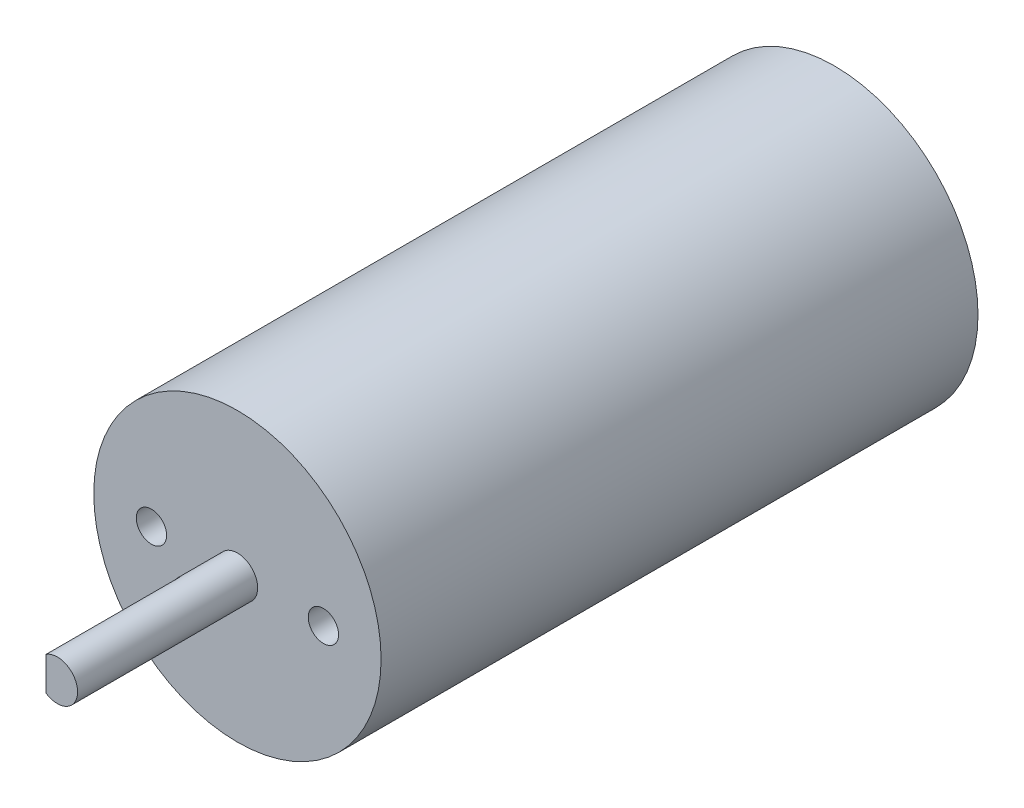
ISO-10303-21;
HEADER;
FILE_DESCRIPTION(('STEP AP214'),'2;1');
FILE_NAME('part.step','',(''),(''),'','','');
FILE_SCHEMA(('AUTOMOTIVE_DESIGN { 1 0 10303 214 1 1 1 1 }'));
ENDSEC;
DATA;
#1=APPLICATION_CONTEXT('core data for automotive mechanical design processes');
#2=APPLICATION_PROTOCOL_DEFINITION('international standard','automotive_design',2000,#1);
#3=PRODUCT_CONTEXT('',#1,'mechanical');
#4=PRODUCT('Part','Part','',(#3));
#5=PRODUCT_RELATED_PRODUCT_CATEGORY('part','',(#4));
#6=PRODUCT_DEFINITION_FORMATION('','',#4);
#7=PRODUCT_DEFINITION_CONTEXT('part definition',#1,'design');
#8=PRODUCT_DEFINITION('design','',#6,#7);
#9=PRODUCT_DEFINITION_SHAPE('','',#8);
#10=(LENGTH_UNIT() NAMED_UNIT(*) SI_UNIT(.MILLI.,.METRE.));
#11=(NAMED_UNIT(*) PLANE_ANGLE_UNIT() SI_UNIT($,.RADIAN.));
#12=(NAMED_UNIT(*) SI_UNIT($,.STERADIAN.) SOLID_ANGLE_UNIT());
#13=UNCERTAINTY_MEASURE_WITH_UNIT(LENGTH_MEASURE(1.E-05),#10,'distance_accuracy_value','');
#14=(GEOMETRIC_REPRESENTATION_CONTEXT(3) GLOBAL_UNCERTAINTY_ASSIGNED_CONTEXT((#13)) GLOBAL_UNIT_ASSIGNED_CONTEXT((#10,
#11,#12)) REPRESENTATION_CONTEXT('',''));
#15=CARTESIAN_POINT('',(0.,0.,0.));
#16=DIRECTION('',(0.,0.,1.));
#17=DIRECTION('',(1.,0.,0.));
#18=AXIS2_PLACEMENT_3D('',#15,#16,#17);
#19=CARTESIAN_POINT('',(0.,0.,76.8));
#20=DIRECTION('',(0.,0.,-1.));
#21=DIRECTION('',(-1.,0.,0.));
#22=AXIS2_PLACEMENT_3D('',#19,#20,#21);
#23=CYLINDRICAL_SURFACE('',#22,2.);
#24=CARTESIAN_POINT('',(0.,0.,59.));
#25=DIRECTION('',(0.,0.,1.));
#26=DIRECTION('',(1.,0.,0.));
#27=AXIS2_PLACEMENT_3D('',#24,#25,#26);
#28=CIRCLE('',#27,2.);
#29=CARTESIAN_POINT('',(2.,0.,59.));
#30=VERTEX_POINT('',#29);
#31=EDGE_CURVE('E91',#30,#30,#28,.T.);
#32=ORIENTED_EDGE('',*,*,#31,.T.);
#33=EDGE_LOOP('',(#32));
#34=FACE_BOUND('',#33,.T.);
#35=DIRECTION('',(0.,0.,-1.));
#36=VECTOR('',#35,1.);
#37=CARTESIAN_POINT('',(-1.12179318114657,1.65577174113253,76.8));
#38=LINE('',#37,#36);
#39=CARTESIAN_POINT('',(-1.12179318114657,1.65577174113253,76.8));
#40=VERTEX_POINT('',#39);
#41=CARTESIAN_POINT('',(-1.12179318114657,1.65577174113253,63.5));
#42=VERTEX_POINT('',#41);
#43=EDGE_CURVE('E75',#40,#42,#38,.T.);
#44=ORIENTED_EDGE('',*,*,#43,.F.);
#45=CARTESIAN_POINT('',(0.,0.,76.8));
#46=DIRECTION('',(0.,0.,1.));
#47=DIRECTION('',(1.,0.,0.));
#48=AXIS2_PLACEMENT_3D('',#45,#46,#47);
#49=CIRCLE('',#48,2.);
#50=CARTESIAN_POINT('',(-1.12179318114657,-1.65577174113253,76.8));
#51=VERTEX_POINT('',#50);
#52=EDGE_CURVE('E80',#51,#40,#49,.T.);
#53=ORIENTED_EDGE('',*,*,#52,.F.);
#54=DIRECTION('',(0.,0.,-1.));
#55=VECTOR('',#54,1.);
#56=CARTESIAN_POINT('',(-1.12179318114657,-1.65577174113253,76.8));
#57=LINE('',#56,#55);
#58=CARTESIAN_POINT('',(-1.12179318114657,-1.65577174113253,63.5));
#59=VERTEX_POINT('',#58);
#60=EDGE_CURVE('E60',#59,#51,#57,.F.);
#61=ORIENTED_EDGE('',*,*,#60,.F.);
#62=CARTESIAN_POINT('',(0.,0.,63.5));
#63=DIRECTION('',(0.,0.,-1.));
#64=DIRECTION('',(-1.,0.,0.));
#65=AXIS2_PLACEMENT_3D('',#62,#63,#64);
#66=CIRCLE('',#65,2.);
#67=EDGE_CURVE('E11',#59,#42,#66,.T.);
#68=ORIENTED_EDGE('',*,*,#67,.T.);
#69=EDGE_LOOP('',(#44,#53,#61,#68));
#70=FACE_BOUND('',#69,.T.);
#71=ADVANCED_FACE('F44',(#34,#70),#23,.T.);
#72=CARTESIAN_POINT('',(0.,0.,76.8));
#73=DIRECTION('',(0.,0.,1.));
#74=DIRECTION('',(1.,0.,0.));
#75=AXIS2_PLACEMENT_3D('',#72,#73,#74);
#76=PLANE('',#75);
#77=ORIENTED_EDGE('',*,*,#52,.T.);
#78=DIRECTION('',(0.,-1.,0.));
#79=VECTOR('',#78,1.);
#80=CARTESIAN_POINT('',(-1.12179318114657,0.,76.8));
#81=LINE('',#80,#79);
#82=EDGE_CURVE('E53',#40,#51,#81,.T.);
#83=ORIENTED_EDGE('',*,*,#82,.T.);
#84=EDGE_LOOP('',(#77,#83));
#85=FACE_BOUND('',#84,.T.);
#86=ADVANCED_FACE('F117',(#85),#76,.T.);
#87=CARTESIAN_POINT('',(0.,0.,59.));
#88=DIRECTION('',(0.,0.,-1.));
#89=DIRECTION('',(-1.,0.,0.));
#90=AXIS2_PLACEMENT_3D('',#87,#88,#89);
#91=CYLINDRICAL_SURFACE('',#90,14.2);
#92=CARTESIAN_POINT('',(0.,0.,59.));
#93=DIRECTION('',(0.,0.,1.));
#94=DIRECTION('',(1.,0.,0.));
#95=AXIS2_PLACEMENT_3D('',#92,#93,#94);
#96=CIRCLE('',#95,14.2);
#97=CARTESIAN_POINT('',(14.2,0.,59.));
#98=VERTEX_POINT('',#97);
#99=EDGE_CURVE('E109',#98,#98,#96,.T.);
#100=ORIENTED_EDGE('',*,*,#99,.F.);
#101=EDGE_LOOP('',(#100));
#102=FACE_BOUND('',#101,.T.);
#103=CARTESIAN_POINT('',(0.,0.,0.));
#104=DIRECTION('',(0.,0.,1.));
#105=DIRECTION('',(1.,0.,0.));
#106=AXIS2_PLACEMENT_3D('',#103,#104,#105);
#107=CIRCLE('',#106,14.2);
#108=CARTESIAN_POINT('',(14.2,0.,0.));
#109=VERTEX_POINT('',#108);
#110=EDGE_CURVE('E105',#109,#109,#107,.T.);
#111=ORIENTED_EDGE('',*,*,#110,.T.);
#112=EDGE_LOOP('',(#111));
#113=FACE_BOUND('',#112,.T.);
#114=ADVANCED_FACE('F46',(#102,#113),#91,.T.);
#115=CARTESIAN_POINT('',(0.,0.,59.));
#116=DIRECTION('',(0.,0.,1.));
#117=DIRECTION('',(1.,0.,0.));
#118=AXIS2_PLACEMENT_3D('',#115,#116,#117);
#119=PLANE('',#118);
#120=CARTESIAN_POINT('',(-8.5,0.,59.));
#121=DIRECTION('',(0.,0.,1.));
#122=DIRECTION('',(1.,0.,0.));
#123=AXIS2_PLACEMENT_3D('',#120,#121,#122);
#124=CIRCLE('',#123,1.5);
#125=CARTESIAN_POINT('',(-7.,0.,59.));
#126=VERTEX_POINT('',#125);
#127=EDGE_CURVE('E92',#126,#126,#124,.T.);
#128=ORIENTED_EDGE('',*,*,#127,.F.);
#129=EDGE_LOOP('',(#128));
#130=FACE_BOUND('',#129,.T.);
#131=CARTESIAN_POINT('',(8.5,0.,59.));
#132=DIRECTION('',(0.,0.,1.));
#133=DIRECTION('',(1.,0.,0.));
#134=AXIS2_PLACEMENT_3D('',#131,#132,#133);
#135=CIRCLE('',#134,1.5);
#136=CARTESIAN_POINT('',(10.,0.,59.));
#137=VERTEX_POINT('',#136);
#138=EDGE_CURVE('E96',#137,#137,#135,.T.);
#139=ORIENTED_EDGE('',*,*,#138,.F.);
#140=EDGE_LOOP('',(#139));
#141=FACE_BOUND('',#140,.T.);
#142=ORIENTED_EDGE('',*,*,#31,.F.);
#143=EDGE_LOOP('',(#142));
#144=FACE_BOUND('',#143,.T.);
#145=ORIENTED_EDGE('',*,*,#99,.T.);
#146=EDGE_LOOP('',(#145));
#147=FACE_BOUND('',#146,.T.);
#148=ADVANCED_FACE('F124',(#130,#141,#144,#147),#119,.T.);
#149=CARTESIAN_POINT('',(0.,0.,0.));
#150=DIRECTION('',(0.,0.,1.));
#151=DIRECTION('',(1.,0.,0.));
#152=AXIS2_PLACEMENT_3D('',#149,#150,#151);
#153=PLANE('',#152);
#154=ORIENTED_EDGE('',*,*,#110,.F.);
#155=EDGE_LOOP('',(#154));
#156=FACE_BOUND('',#155,.T.);
#157=ADVANCED_FACE('F133',(#156),#153,.F.);
#158=CARTESIAN_POINT('',(8.5,0.,54.6058));
#159=DIRECTION('',(0.,0.,1.));
#160=DIRECTION('',(1.,0.,0.));
#161=AXIS2_PLACEMENT_3D('',#158,#159,#160);
#162=CYLINDRICAL_SURFACE('',#161,1.5);
#163=CARTESIAN_POINT('',(8.5,0.,54.6058));
#164=DIRECTION('',(0.,0.,1.));
#165=DIRECTION('',(1.,0.,0.));
#166=AXIS2_PLACEMENT_3D('',#163,#164,#165);
#167=CIRCLE('',#166,1.5);
#168=CARTESIAN_POINT('',(10.,0.,54.6058));
#169=VERTEX_POINT('',#168);
#170=EDGE_CURVE('E84',#169,#169,#167,.T.);
#171=ORIENTED_EDGE('',*,*,#170,.F.);
#172=EDGE_LOOP('',(#171));
#173=FACE_BOUND('',#172,.T.);
#174=ORIENTED_EDGE('',*,*,#138,.T.);
#175=EDGE_LOOP('',(#174));
#176=FACE_BOUND('',#175,.T.);
#177=ADVANCED_FACE('F136',(#173,#176),#162,.F.);
#178=CARTESIAN_POINT('',(8.5,0.,54.6058));
#179=DIRECTION('',(0.,0.,1.));
#180=DIRECTION('',(1.,0.,0.));
#181=AXIS2_PLACEMENT_3D('',#178,#179,#180);
#182=PLANE('',#181);
#183=ORIENTED_EDGE('',*,*,#170,.T.);
#184=EDGE_LOOP('',(#183));
#185=FACE_BOUND('',#184,.T.);
#186=ADVANCED_FACE('F129',(#185),#182,.T.);
#187=CARTESIAN_POINT('',(-8.5,0.,54.6058));
#188=DIRECTION('',(0.,0.,1.));
#189=DIRECTION('',(1.,0.,0.));
#190=AXIS2_PLACEMENT_3D('',#187,#188,#189);
#191=CYLINDRICAL_SURFACE('',#190,1.5);
#192=CARTESIAN_POINT('',(-8.5,0.,54.6058));
#193=DIRECTION('',(0.,0.,1.));
#194=DIRECTION('',(1.,0.,0.));
#195=AXIS2_PLACEMENT_3D('',#192,#193,#194);
#196=CIRCLE('',#195,1.5);
#197=CARTESIAN_POINT('',(-7.,0.,54.6058));
#198=VERTEX_POINT('',#197);
#199=EDGE_CURVE('E87',#198,#198,#196,.T.);
#200=ORIENTED_EDGE('',*,*,#199,.F.);
#201=EDGE_LOOP('',(#200));
#202=FACE_BOUND('',#201,.T.);
#203=ORIENTED_EDGE('',*,*,#127,.T.);
#204=EDGE_LOOP('',(#203));
#205=FACE_BOUND('',#204,.T.);
#206=ADVANCED_FACE('F147',(#202,#205),#191,.F.);
#207=CARTESIAN_POINT('',(-8.5,0.,54.6058));
#208=DIRECTION('',(0.,0.,1.));
#209=DIRECTION('',(1.,0.,0.));
#210=AXIS2_PLACEMENT_3D('',#207,#208,#209);
#211=PLANE('',#210);
#212=ORIENTED_EDGE('',*,*,#199,.T.);
#213=EDGE_LOOP('',(#212));
#214=FACE_BOUND('',#213,.T.);
#215=ADVANCED_FACE('F154',(#214),#211,.T.);
#216=CARTESIAN_POINT('',(0.,0.,63.5));
#217=DIRECTION('',(0.,0.,-1.));
#218=DIRECTION('',(-1.,0.,0.));
#219=AXIS2_PLACEMENT_3D('',#216,#217,#218);
#220=PLANE('',#219);
#221=DIRECTION('',(0.,1.,0.));
#222=VECTOR('',#221,1.);
#223=CARTESIAN_POINT('',(-1.12179318114657,2.03962396572122,63.5));
#224=LINE('',#223,#222);
#225=EDGE_CURVE('E72',#59,#42,#224,.T.);
#226=ORIENTED_EDGE('',*,*,#225,.T.);
#227=ORIENTED_EDGE('',*,*,#67,.F.);
#228=EDGE_LOOP('',(#226,#227));
#229=FACE_BOUND('',#228,.T.);
#230=ADVANCED_FACE('F71',(#229),#220,.F.);
#231=CARTESIAN_POINT('',(-1.12179318114657,2.03962396572122,77.216));
#232=DIRECTION('',(-1.,0.,0.));
#233=DIRECTION('',(0.,0.,1.));
#234=AXIS2_PLACEMENT_3D('',#231,#232,#233);
#235=PLANE('',#234);
#236=ORIENTED_EDGE('',*,*,#43,.T.);
#237=ORIENTED_EDGE('',*,*,#225,.F.);
#238=ORIENTED_EDGE('',*,*,#60,.T.);
#239=ORIENTED_EDGE('',*,*,#82,.F.);
#240=EDGE_LOOP('',(#236,#237,#238,#239));
#241=FACE_BOUND('',#240,.T.);
#242=ADVANCED_FACE('F74',(#241),#235,.T.);
#243=CLOSED_SHELL('',(#71,#86,#114,#148,#157,#177,#186,#206,#215,#230,#242));
#244=MANIFOLD_SOLID_BREP('B2',#243);
#245=ADVANCED_BREP_SHAPE_REPRESENTATION('',(#18,#244),#14);
#246=SHAPE_DEFINITION_REPRESENTATION(#9,#245);
ENDSEC;
END-ISO-10303-21;
